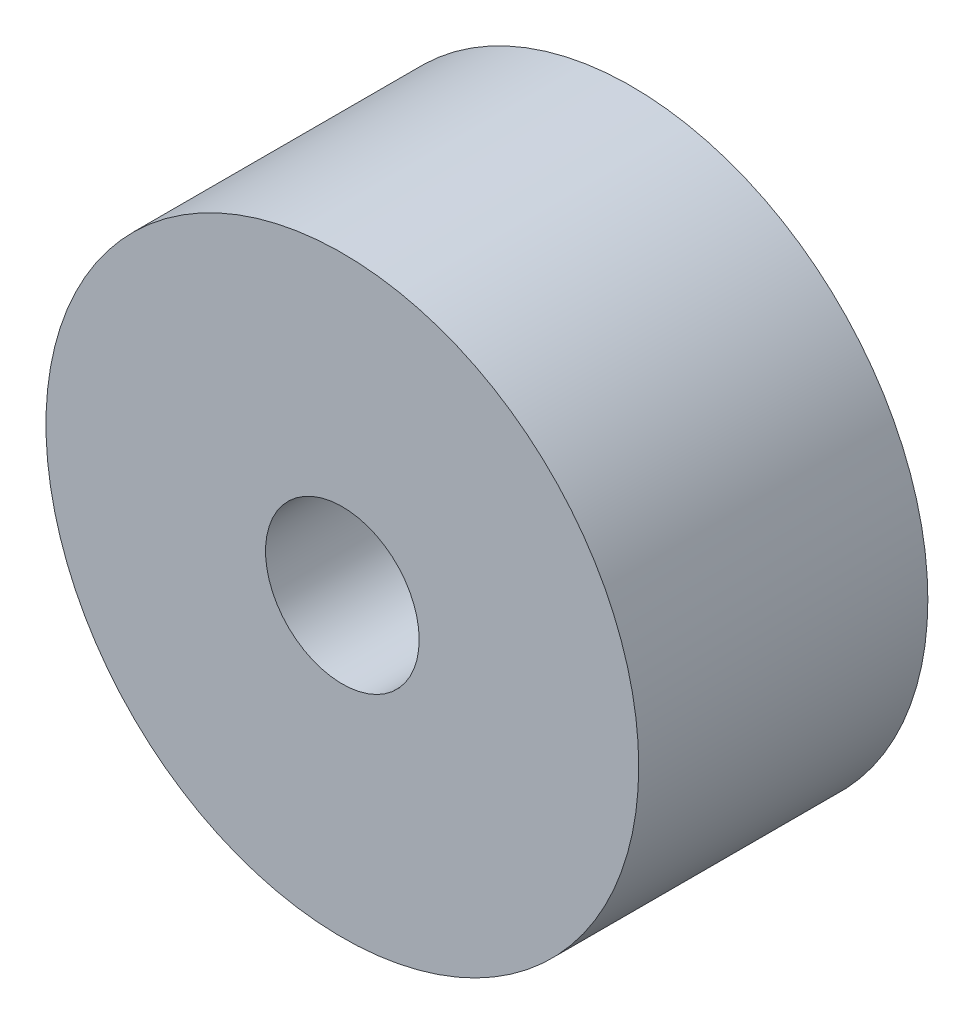
ISO-10303-21;
HEADER;
FILE_DESCRIPTION(('STEP AP214'),'2;1');
FILE_NAME('part.step','',(''),(''),'','','');
FILE_SCHEMA(('AUTOMOTIVE_DESIGN { 1 0 10303 214 1 1 1 1 }'));
ENDSEC;
DATA;
#1=APPLICATION_CONTEXT('core data for automotive mechanical design processes');
#2=APPLICATION_PROTOCOL_DEFINITION('international standard','automotive_design',2000,#1);
#3=PRODUCT_CONTEXT('',#1,'mechanical');
#4=PRODUCT('Part','Part','',(#3));
#5=PRODUCT_RELATED_PRODUCT_CATEGORY('part','',(#4));
#6=PRODUCT_DEFINITION_FORMATION('','',#4);
#7=PRODUCT_DEFINITION_CONTEXT('part definition',#1,'design');
#8=PRODUCT_DEFINITION('design','',#6,#7);
#9=PRODUCT_DEFINITION_SHAPE('','',#8);
#10=(LENGTH_UNIT() NAMED_UNIT(*) SI_UNIT(.MILLI.,.METRE.));
#11=(NAMED_UNIT(*) PLANE_ANGLE_UNIT() SI_UNIT($,.RADIAN.));
#12=(NAMED_UNIT(*) SI_UNIT($,.STERADIAN.) SOLID_ANGLE_UNIT());
#13=UNCERTAINTY_MEASURE_WITH_UNIT(LENGTH_MEASURE(1.E-05),#10,'distance_accuracy_value','');
#14=(GEOMETRIC_REPRESENTATION_CONTEXT(3) GLOBAL_UNCERTAINTY_ASSIGNED_CONTEXT((#13)) GLOBAL_UNIT_ASSIGNED_CONTEXT((#10,
#11,#12)) REPRESENTATION_CONTEXT('',''));
#15=CARTESIAN_POINT('',(0.,0.,0.));
#16=DIRECTION('',(0.,0.,1.));
#17=DIRECTION('',(1.,0.,0.));
#18=AXIS2_PLACEMENT_3D('',#15,#16,#17);
#19=CARTESIAN_POINT('',(0.,0.,23.9));
#20=DIRECTION('',(0.,0.,-1.));
#21=DIRECTION('',(-1.,0.,0.));
#22=AXIS2_PLACEMENT_3D('',#19,#20,#21);
#23=CYLINDRICAL_SURFACE('',#22,24.5);
#24=CARTESIAN_POINT('',(0.,0.,23.9));
#25=DIRECTION('',(0.,0.,1.));
#26=DIRECTION('',(1.,0.,0.));
#27=AXIS2_PLACEMENT_3D('',#24,#25,#26);
#28=CIRCLE('',#27,24.5);
#29=CARTESIAN_POINT('',(24.5,0.,23.9));
#30=VERTEX_POINT('',#29);
#31=EDGE_CURVE('E10',#30,#30,#28,.T.);
#32=ORIENTED_EDGE('',*,*,#31,.F.);
#33=EDGE_LOOP('',(#32));
#34=FACE_BOUND('',#33,.T.);
#35=CARTESIAN_POINT('',(0.,0.,0.));
#36=DIRECTION('',(0.,0.,1.));
#37=DIRECTION('',(1.,0.,0.));
#38=AXIS2_PLACEMENT_3D('',#35,#36,#37);
#39=CIRCLE('',#38,24.5);
#40=CARTESIAN_POINT('',(24.5,0.,0.));
#41=VERTEX_POINT('',#40);
#42=EDGE_CURVE('E42',#41,#41,#39,.T.);
#43=ORIENTED_EDGE('',*,*,#42,.T.);
#44=EDGE_LOOP('',(#43));
#45=FACE_BOUND('',#44,.T.);
#46=ADVANCED_FACE('F39',(#34,#45),#23,.T.);
#47=CARTESIAN_POINT('',(0.,0.,23.9));
#48=DIRECTION('',(0.,0.,1.));
#49=DIRECTION('',(1.,0.,0.));
#50=AXIS2_PLACEMENT_3D('',#47,#48,#49);
#51=PLANE('',#50);
#52=CARTESIAN_POINT('',(0.,0.,23.9));
#53=DIRECTION('',(0.,0.,1.));
#54=DIRECTION('',(1.,0.,0.));
#55=AXIS2_PLACEMENT_3D('',#52,#53,#54);
#56=CIRCLE('',#55,6.35);
#57=CARTESIAN_POINT('',(6.35,0.,23.9));
#58=VERTEX_POINT('',#57);
#59=EDGE_CURVE('E51',#58,#58,#56,.T.);
#60=ORIENTED_EDGE('',*,*,#59,.F.);
#61=EDGE_LOOP('',(#60));
#62=FACE_BOUND('',#61,.T.);
#63=ORIENTED_EDGE('',*,*,#31,.T.);
#64=EDGE_LOOP('',(#63));
#65=FACE_BOUND('',#64,.T.);
#66=ADVANCED_FACE('F66',(#62,#65),#51,.T.);
#67=CARTESIAN_POINT('',(0.,0.,0.));
#68=DIRECTION('',(0.,0.,1.));
#69=DIRECTION('',(1.,0.,0.));
#70=AXIS2_PLACEMENT_3D('',#67,#68,#69);
#71=PLANE('',#70);
#72=ORIENTED_EDGE('',*,*,#42,.F.);
#73=EDGE_LOOP('',(#72));
#74=FACE_BOUND('',#73,.T.);
#75=ADVANCED_FACE('F62',(#74),#71,.F.);
#76=CARTESIAN_POINT('',(0.,0.,13.9));
#77=DIRECTION('',(0.,0.,1.));
#78=DIRECTION('',(1.,0.,0.));
#79=AXIS2_PLACEMENT_3D('',#76,#77,#78);
#80=CYLINDRICAL_SURFACE('',#79,6.35);
#81=CARTESIAN_POINT('',(0.,0.,13.9));
#82=DIRECTION('',(0.,0.,1.));
#83=DIRECTION('',(1.,0.,0.));
#84=AXIS2_PLACEMENT_3D('',#81,#82,#83);
#85=CIRCLE('',#84,6.35);
#86=CARTESIAN_POINT('',(6.35,0.,13.9));
#87=VERTEX_POINT('',#86);
#88=EDGE_CURVE('E49',#87,#87,#85,.T.);
#89=ORIENTED_EDGE('',*,*,#88,.F.);
#90=EDGE_LOOP('',(#89));
#91=FACE_BOUND('',#90,.T.);
#92=ORIENTED_EDGE('',*,*,#59,.T.);
#93=EDGE_LOOP('',(#92));
#94=FACE_BOUND('',#93,.T.);
#95=ADVANCED_FACE('F59',(#91,#94),#80,.F.);
#96=CARTESIAN_POINT('',(0.,0.,13.9));
#97=DIRECTION('',(0.,0.,1.));
#98=DIRECTION('',(1.,0.,0.));
#99=AXIS2_PLACEMENT_3D('',#96,#97,#98);
#100=PLANE('',#99);
#101=ORIENTED_EDGE('',*,*,#88,.T.);
#102=EDGE_LOOP('',(#101));
#103=FACE_BOUND('',#102,.T.);
#104=ADVANCED_FACE('F57',(#103),#100,.T.);
#105=CLOSED_SHELL('',(#46,#66,#75,#95,#104));
#106=MANIFOLD_SOLID_BREP('B2',#105);
#107=ADVANCED_BREP_SHAPE_REPRESENTATION('',(#18,#106),#14);
#108=SHAPE_DEFINITION_REPRESENTATION(#9,#107);
ENDSEC;
END-ISO-10303-21;
